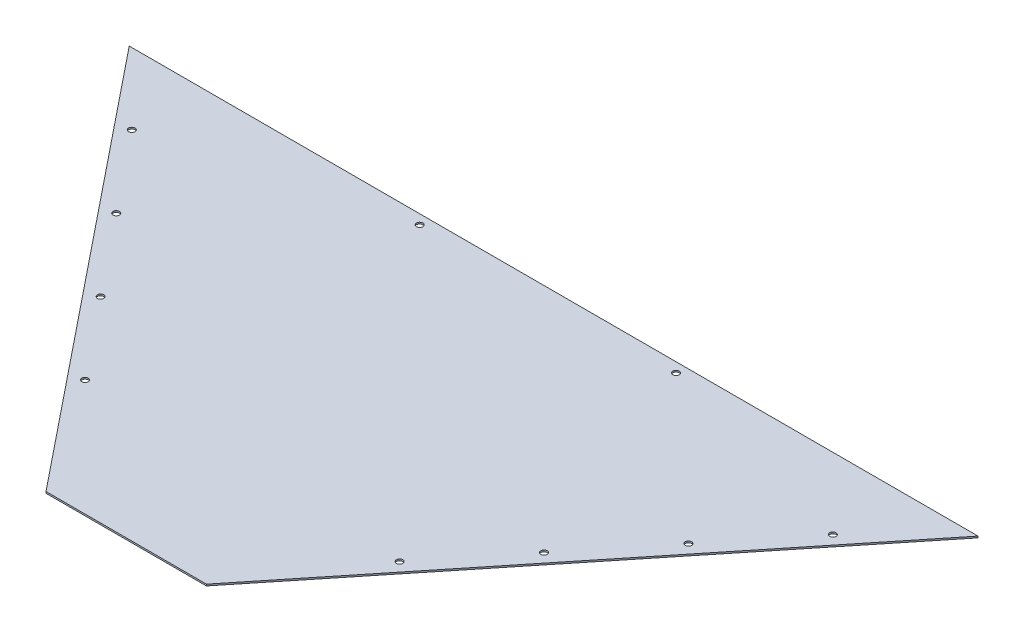
ISO-10303-21;
HEADER;
FILE_DESCRIPTION(('STEP AP214'),'2;1');
FILE_NAME('part.step','',(''),(''),'','','');
FILE_SCHEMA(('AUTOMOTIVE_DESIGN { 1 0 10303 214 1 1 1 1 }'));
ENDSEC;
DATA;
#1=APPLICATION_CONTEXT('core data for automotive mechanical design processes');
#2=APPLICATION_PROTOCOL_DEFINITION('international standard','automotive_design',2000,#1);
#3=PRODUCT_CONTEXT('',#1,'mechanical');
#4=PRODUCT('Part','Part','',(#3));
#5=PRODUCT_RELATED_PRODUCT_CATEGORY('part','',(#4));
#6=PRODUCT_DEFINITION_FORMATION('','',#4);
#7=PRODUCT_DEFINITION_CONTEXT('part definition',#1,'design');
#8=PRODUCT_DEFINITION('design','',#6,#7);
#9=PRODUCT_DEFINITION_SHAPE('','',#8);
#10=(LENGTH_UNIT() NAMED_UNIT(*) SI_UNIT(.MILLI.,.METRE.));
#11=(NAMED_UNIT(*) PLANE_ANGLE_UNIT() SI_UNIT($,.RADIAN.));
#12=(NAMED_UNIT(*) SI_UNIT($,.STERADIAN.) SOLID_ANGLE_UNIT());
#13=UNCERTAINTY_MEASURE_WITH_UNIT(LENGTH_MEASURE(1.E-05),#10,'distance_accuracy_value','');
#14=(GEOMETRIC_REPRESENTATION_CONTEXT(3) GLOBAL_UNCERTAINTY_ASSIGNED_CONTEXT((#13)) GLOBAL_UNIT_ASSIGNED_CONTEXT((#10,
#11,#12)) REPRESENTATION_CONTEXT('',''));
#15=CARTESIAN_POINT('',(0.,0.,0.));
#16=DIRECTION('',(0.,0.,1.));
#17=DIRECTION('',(1.,0.,0.));
#18=AXIS2_PLACEMENT_3D('',#15,#16,#17);
#19=CARTESIAN_POINT('',(-681.0375,3.175,-845.729357474216));
#20=DIRECTION('',(0.778863892318659,0.,-0.62719298245614));
#21=DIRECTION('',(-0.627192982456141,0.,-0.778863892318659));
#22=AXIS2_PLACEMENT_3D('',#19,#20,#21);
#23=PLANE('',#22);
#24=DIRECTION('',(0.62719298245614,0.,0.778863892318659));
#25=VECTOR('',#24,1.);
#26=CARTESIAN_POINT('',(-681.0375,0.,-845.729357474216));
#27=LINE('',#26,#25);
#28=CARTESIAN_POINT('',(-681.0375,0.,-845.729357474216));
#29=VERTEX_POINT('',#28);
#30=CARTESIAN_POINT('',(0.,0.,0.));
#31=VERTEX_POINT('',#30);
#32=EDGE_CURVE('E97',#29,#31,#27,.T.);
#33=ORIENTED_EDGE('',*,*,#32,.T.);
#34=DIRECTION('',(0.,-1.,0.));
#35=VECTOR('',#34,1.);
#36=CARTESIAN_POINT('',(0.,3.175,0.));
#37=LINE('',#36,#35);
#38=CARTESIAN_POINT('',(0.,3.175,0.));
#39=VERTEX_POINT('',#38);
#40=EDGE_CURVE('E11',#39,#31,#37,.T.);
#41=ORIENTED_EDGE('',*,*,#40,.F.);
#42=DIRECTION('',(0.62719298245614,0.,0.778863892318659));
#43=VECTOR('',#42,1.);
#44=CARTESIAN_POINT('',(-681.0375,3.175,-845.729357474216));
#45=LINE('',#44,#43);
#46=CARTESIAN_POINT('',(-681.0375,3.175,-845.729357474216));
#47=VERTEX_POINT('',#46);
#48=EDGE_CURVE('E85',#47,#39,#45,.T.);
#49=ORIENTED_EDGE('',*,*,#48,.F.);
#50=DIRECTION('',(0.,-1.,0.));
#51=VECTOR('',#50,1.);
#52=CARTESIAN_POINT('',(-681.0375,3.175,-845.729357474216));
#53=LINE('',#52,#51);
#54=EDGE_CURVE('E93',#47,#29,#53,.T.);
#55=ORIENTED_EDGE('',*,*,#54,.T.);
#56=EDGE_LOOP('',(#33,#41,#49,#55));
#57=FACE_BOUND('',#56,.T.);
#58=ADVANCED_FACE('F34',(#57),#23,.F.);
#59=CARTESIAN_POINT('',(0.,3.175,0.));
#60=DIRECTION('',(0.,0.,-1.));
#61=DIRECTION('',(-1.,0.,0.));
#62=AXIS2_PLACEMENT_3D('',#59,#60,#61);
#63=PLANE('',#62);
#64=DIRECTION('',(1.,0.,0.));
#65=VECTOR('',#64,1.);
#66=CARTESIAN_POINT('',(0.,0.,0.));
#67=LINE('',#66,#65);
#68=CARTESIAN_POINT('',(317.5,0.,0.));
#69=VERTEX_POINT('',#68);
#70=EDGE_CURVE('E89',#31,#69,#67,.T.);
#71=ORIENTED_EDGE('',*,*,#70,.T.);
#72=DIRECTION('',(0.,-1.,0.));
#73=VECTOR('',#72,1.);
#74=CARTESIAN_POINT('',(317.5,3.175,0.));
#75=LINE('',#74,#73);
#76=CARTESIAN_POINT('',(317.5,3.175,0.));
#77=VERTEX_POINT('',#76);
#78=EDGE_CURVE('E42',#77,#69,#75,.T.);
#79=ORIENTED_EDGE('',*,*,#78,.F.);
#80=DIRECTION('',(1.,0.,0.));
#81=VECTOR('',#80,1.);
#82=CARTESIAN_POINT('',(0.,3.175,0.));
#83=LINE('',#82,#81);
#84=EDGE_CURVE('E80',#39,#77,#83,.T.);
#85=ORIENTED_EDGE('',*,*,#84,.F.);
#86=ORIENTED_EDGE('',*,*,#40,.T.);
#87=EDGE_LOOP('',(#71,#79,#85,#86));
#88=FACE_BOUND('',#87,.T.);
#89=ADVANCED_FACE('F88',(#88),#63,.F.);
#90=CARTESIAN_POINT('',(317.5,3.175,0.));
#91=DIRECTION('',(-0.778863892318659,0.,-0.62719298245614));
#92=DIRECTION('',(-0.62719298245614,0.,0.778863892318659));
#93=AXIS2_PLACEMENT_3D('',#90,#91,#92);
#94=PLANE('',#93);
#95=DIRECTION('',(0.62719298245614,0.,-0.778863892318659));
#96=VECTOR('',#95,1.);
#97=CARTESIAN_POINT('',(317.5,0.,0.));
#98=LINE('',#97,#96);
#99=CARTESIAN_POINT('',(998.5375,0.,-845.729357474216));
#100=VERTEX_POINT('',#99);
#101=EDGE_CURVE('E67',#69,#100,#98,.T.);
#102=ORIENTED_EDGE('',*,*,#101,.T.);
#103=DIRECTION('',(0.,-1.,0.));
#104=VECTOR('',#103,1.);
#105=CARTESIAN_POINT('',(998.5375,3.175,-845.729357474216));
#106=LINE('',#105,#104);
#107=CARTESIAN_POINT('',(998.5375,3.175,-845.729357474216));
#108=VERTEX_POINT('',#107);
#109=EDGE_CURVE('E90',#108,#100,#106,.T.);
#110=ORIENTED_EDGE('',*,*,#109,.F.);
#111=DIRECTION('',(0.62719298245614,0.,-0.778863892318659));
#112=VECTOR('',#111,1.);
#113=CARTESIAN_POINT('',(317.5,3.175,0.));
#114=LINE('',#113,#112);
#115=EDGE_CURVE('E83',#77,#108,#114,.T.);
#116=ORIENTED_EDGE('',*,*,#115,.F.);
#117=ORIENTED_EDGE('',*,*,#78,.T.);
#118=EDGE_LOOP('',(#102,#110,#116,#117));
#119=FACE_BOUND('',#118,.T.);
#120=ADVANCED_FACE('F91',(#119),#94,.F.);
#121=CARTESIAN_POINT('',(998.5375,3.175,-845.729357474216));
#122=DIRECTION('',(0.,0.,1.));
#123=DIRECTION('',(1.,0.,0.));
#124=AXIS2_PLACEMENT_3D('',#121,#122,#123);
#125=PLANE('',#124);
#126=DIRECTION('',(-1.,0.,0.));
#127=VECTOR('',#126,1.);
#128=CARTESIAN_POINT('',(998.5375,0.,-845.729357474216));
#129=LINE('',#128,#127);
#130=EDGE_CURVE('E73',#100,#29,#129,.T.);
#131=ORIENTED_EDGE('',*,*,#130,.T.);
#132=ORIENTED_EDGE('',*,*,#54,.F.);
#133=DIRECTION('',(-1.,0.,0.));
#134=VECTOR('',#133,1.);
#135=CARTESIAN_POINT('',(998.5375,3.175,-845.729357474216));
#136=LINE('',#135,#134);
#137=EDGE_CURVE('E50',#108,#47,#136,.T.);
#138=ORIENTED_EDGE('',*,*,#137,.F.);
#139=ORIENTED_EDGE('',*,*,#109,.T.);
#140=EDGE_LOOP('',(#131,#132,#138,#139));
#141=FACE_BOUND('',#140,.T.);
#142=ADVANCED_FACE('F105',(#141),#125,.F.);
#143=CARTESIAN_POINT('',(158.75,3.175,197.13971036695));
#144=DIRECTION('',(0.,1.,0.));
#145=DIRECTION('',(0.,0.,1.));
#146=AXIS2_PLACEMENT_3D('',#143,#144,#145);
#147=PLANE('',#146);
#148=CARTESIAN_POINT('',(-152.471489871306,3.175,-229.840801955833));
#149=DIRECTION('',(0.,1.,0.));
#150=DIRECTION('',(0.,0.,-1.));
#151=AXIS2_PLACEMENT_3D('',#148,#149,#150);
#152=CIRCLE('',#151,6.34999999999999);
#153=CARTESIAN_POINT('',(-152.471489871306,3.175,-236.190801955833));
#154=VERTEX_POINT('',#153);
#155=EDGE_CURVE('E165',#154,#154,#152,.T.);
#156=ORIENTED_EDGE('',*,*,#155,.F.);
#157=EDGE_LOOP('',(#156));
#158=FACE_BOUND('',#157,.T.);
#159=CARTESIAN_POINT('',(-279.917103906393,3.175,-388.105944874985));
#160=DIRECTION('',(0.,1.,0.));
#161=DIRECTION('',(0.,0.,-1.));
#162=AXIS2_PLACEMENT_3D('',#159,#160,#161);
#163=CIRCLE('',#162,6.34999999999994);
#164=CARTESIAN_POINT('',(-279.917103906393,3.175,-394.455944874985));
#165=VERTEX_POINT('',#164);
#166=EDGE_CURVE('E159',#165,#165,#163,.T.);
#167=ORIENTED_EDGE('',*,*,#166,.F.);
#168=EDGE_LOOP('',(#167));
#169=FACE_BOUND('',#168,.T.);
#170=CARTESIAN_POINT('',(-407.362717941481,3.175,-546.371087794137));
#171=DIRECTION('',(0.,1.,0.));
#172=DIRECTION('',(0.,0.,-1.));
#173=AXIS2_PLACEMENT_3D('',#170,#171,#172);
#174=CIRCLE('',#173,6.34999999999994);
#175=CARTESIAN_POINT('',(-407.362717941481,3.175,-552.721087794137));
#176=VERTEX_POINT('',#175);
#177=EDGE_CURVE('E153',#176,#176,#174,.T.);
#178=ORIENTED_EDGE('',*,*,#177,.F.);
#179=EDGE_LOOP('',(#178));
#180=FACE_BOUND('',#179,.T.);
#181=CARTESIAN_POINT('',(-534.808331976569,3.175,-704.636230713288));
#182=DIRECTION('',(0.,1.,0.));
#183=DIRECTION('',(0.,0.,-1.));
#184=AXIS2_PLACEMENT_3D('',#181,#182,#183);
#185=CIRCLE('',#184,6.34999999999994);
#186=CARTESIAN_POINT('',(-534.808331976569,3.175,-710.986230713288));
#187=VERTEX_POINT('',#186);
#188=EDGE_CURVE('E147',#187,#187,#185,.T.);
#189=ORIENTED_EDGE('',*,*,#188,.F.);
#190=EDGE_LOOP('',(#189));
#191=FACE_BOUND('',#190,.T.);
#192=CARTESIAN_POINT('',(597.417103906393,3.175,-388.105944874985));
#193=DIRECTION('',(0.,1.,0.));
#194=DIRECTION('',(0.,0.,1.));
#195=AXIS2_PLACEMENT_3D('',#192,#193,#194);
#196=CIRCLE('',#195,6.34999999999994);
#197=CARTESIAN_POINT('',(597.417103906393,3.175,-381.755944874985));
#198=VERTEX_POINT('',#197);
#199=EDGE_CURVE('E141',#198,#198,#196,.T.);
#200=ORIENTED_EDGE('',*,*,#199,.F.);
#201=EDGE_LOOP('',(#200));
#202=FACE_BOUND('',#201,.T.);
#203=CARTESIAN_POINT('',(724.862717941481,3.175,-546.371087794137));
#204=DIRECTION('',(0.,1.,0.));
#205=DIRECTION('',(0.,0.,1.));
#206=AXIS2_PLACEMENT_3D('',#203,#204,#205);
#207=CIRCLE('',#206,6.34999999999994);
#208=CARTESIAN_POINT('',(724.862717941481,3.175,-540.021087794137));
#209=VERTEX_POINT('',#208);
#210=EDGE_CURVE('E135',#209,#209,#207,.T.);
#211=ORIENTED_EDGE('',*,*,#210,.F.);
#212=EDGE_LOOP('',(#211));
#213=FACE_BOUND('',#212,.T.);
#214=CARTESIAN_POINT('',(469.971489871306,3.175,-229.840801955834));
#215=DIRECTION('',(0.,1.,0.));
#216=DIRECTION('',(0.,0.,1.));
#217=AXIS2_PLACEMENT_3D('',#214,#215,#216);
#218=CIRCLE('',#217,6.34999999999999);
#219=CARTESIAN_POINT('',(469.971489871306,3.175,-223.490801955834));
#220=VERTEX_POINT('',#219);
#221=EDGE_CURVE('E129',#220,#220,#218,.T.);
#222=ORIENTED_EDGE('',*,*,#221,.F.);
#223=EDGE_LOOP('',(#222));
#224=FACE_BOUND('',#223,.T.);
#225=CARTESIAN_POINT('',(852.308331976569,3.175,-704.636230713288));
#226=DIRECTION('',(0.,1.,0.));
#227=DIRECTION('',(0.,0.,1.));
#228=AXIS2_PLACEMENT_3D('',#225,#226,#227);
#229=CIRCLE('',#228,6.34999999999994);
#230=CARTESIAN_POINT('',(852.308331976569,3.175,-698.286230713288));
#231=VERTEX_POINT('',#230);
#232=EDGE_CURVE('E123',#231,#231,#229,.T.);
#233=ORIENTED_EDGE('',*,*,#232,.F.);
#234=EDGE_LOOP('',(#233));
#235=FACE_BOUND('',#234,.T.);
#236=CARTESIAN_POINT('',(420.1795,3.175,-826.679357474216));
#237=DIRECTION('',(0.,1.,0.));
#238=DIRECTION('',(0.,0.,1.));
#239=AXIS2_PLACEMENT_3D('',#236,#237,#238);
#240=CIRCLE('',#239,6.34999999999994);
#241=CARTESIAN_POINT('',(420.1795,3.175,-820.329357474216));
#242=VERTEX_POINT('',#241);
#243=EDGE_CURVE('E119',#242,#242,#240,.T.);
#244=ORIENTED_EDGE('',*,*,#243,.F.);
#245=EDGE_LOOP('',(#244));
#246=FACE_BOUND('',#245,.T.);
#247=CARTESIAN_POINT('',(-87.1855000000001,3.175,-826.679357474216));
#248=DIRECTION('',(0.,1.,0.));
#249=DIRECTION('',(0.,0.,1.));
#250=AXIS2_PLACEMENT_3D('',#247,#248,#249);
#251=CIRCLE('',#250,6.34999999999999);
#252=CARTESIAN_POINT('',(-87.1855000000001,3.175,-820.329357474216));
#253=VERTEX_POINT('',#252);
#254=EDGE_CURVE('E113',#253,#253,#251,.T.);
#255=ORIENTED_EDGE('',*,*,#254,.F.);
#256=EDGE_LOOP('',(#255));
#257=FACE_BOUND('',#256,.T.);
#258=ORIENTED_EDGE('',*,*,#48,.T.);
#259=ORIENTED_EDGE('',*,*,#84,.T.);
#260=ORIENTED_EDGE('',*,*,#115,.T.);
#261=ORIENTED_EDGE('',*,*,#137,.T.);
#262=EDGE_LOOP('',(#258,#259,#260,#261));
#263=FACE_BOUND('',#262,.T.);
#264=ADVANCED_FACE('F81',(#158,#169,#180,#191,#202,#213,#224,#235,#246,#257,#263),#147,.T.);
#265=CARTESIAN_POINT('',(158.75,0.,197.13971036695));
#266=DIRECTION('',(0.,1.,0.));
#267=DIRECTION('',(0.,0.,1.));
#268=AXIS2_PLACEMENT_3D('',#265,#266,#267);
#269=PLANE('',#268);
#270=CARTESIAN_POINT('',(-152.471489871306,0.,-229.840801955833));
#271=DIRECTION('',(0.,1.,0.));
#272=DIRECTION('',(0.,0.,-1.));
#273=AXIS2_PLACEMENT_3D('',#270,#271,#272);
#274=CIRCLE('',#273,6.34999999999999);
#275=CARTESIAN_POINT('',(-152.471489871306,0.,-236.190801955833));
#276=VERTEX_POINT('',#275);
#277=EDGE_CURVE('E162',#276,#276,#274,.T.);
#278=ORIENTED_EDGE('',*,*,#277,.T.);
#279=EDGE_LOOP('',(#278));
#280=FACE_BOUND('',#279,.T.);
#281=CARTESIAN_POINT('',(-279.917103906393,0.,-388.105944874985));
#282=DIRECTION('',(0.,1.,0.));
#283=DIRECTION('',(0.,0.,-1.));
#284=AXIS2_PLACEMENT_3D('',#281,#282,#283);
#285=CIRCLE('',#284,6.34999999999994);
#286=CARTESIAN_POINT('',(-279.917103906393,0.,-394.455944874985));
#287=VERTEX_POINT('',#286);
#288=EDGE_CURVE('E156',#287,#287,#285,.T.);
#289=ORIENTED_EDGE('',*,*,#288,.T.);
#290=EDGE_LOOP('',(#289));
#291=FACE_BOUND('',#290,.T.);
#292=CARTESIAN_POINT('',(-407.362717941481,0.,-546.371087794137));
#293=DIRECTION('',(0.,1.,0.));
#294=DIRECTION('',(0.,0.,-1.));
#295=AXIS2_PLACEMENT_3D('',#292,#293,#294);
#296=CIRCLE('',#295,6.34999999999994);
#297=CARTESIAN_POINT('',(-407.362717941481,0.,-552.721087794137));
#298=VERTEX_POINT('',#297);
#299=EDGE_CURVE('E150',#298,#298,#296,.T.);
#300=ORIENTED_EDGE('',*,*,#299,.T.);
#301=EDGE_LOOP('',(#300));
#302=FACE_BOUND('',#301,.T.);
#303=CARTESIAN_POINT('',(-534.808331976569,0.,-704.636230713288));
#304=DIRECTION('',(0.,1.,0.));
#305=DIRECTION('',(0.,0.,-1.));
#306=AXIS2_PLACEMENT_3D('',#303,#304,#305);
#307=CIRCLE('',#306,6.34999999999994);
#308=CARTESIAN_POINT('',(-534.808331976569,0.,-710.986230713288));
#309=VERTEX_POINT('',#308);
#310=EDGE_CURVE('E144',#309,#309,#307,.T.);
#311=ORIENTED_EDGE('',*,*,#310,.T.);
#312=EDGE_LOOP('',(#311));
#313=FACE_BOUND('',#312,.T.);
#314=CARTESIAN_POINT('',(597.417103906393,0.,-388.105944874985));
#315=DIRECTION('',(0.,1.,0.));
#316=DIRECTION('',(0.,0.,1.));
#317=AXIS2_PLACEMENT_3D('',#314,#315,#316);
#318=CIRCLE('',#317,6.34999999999994);
#319=CARTESIAN_POINT('',(597.417103906393,0.,-381.755944874985));
#320=VERTEX_POINT('',#319);
#321=EDGE_CURVE('E138',#320,#320,#318,.T.);
#322=ORIENTED_EDGE('',*,*,#321,.T.);
#323=EDGE_LOOP('',(#322));
#324=FACE_BOUND('',#323,.T.);
#325=CARTESIAN_POINT('',(724.862717941481,0.,-546.371087794137));
#326=DIRECTION('',(0.,1.,0.));
#327=DIRECTION('',(0.,0.,1.));
#328=AXIS2_PLACEMENT_3D('',#325,#326,#327);
#329=CIRCLE('',#328,6.34999999999994);
#330=CARTESIAN_POINT('',(724.862717941481,0.,-540.021087794137));
#331=VERTEX_POINT('',#330);
#332=EDGE_CURVE('E132',#331,#331,#329,.T.);
#333=ORIENTED_EDGE('',*,*,#332,.T.);
#334=EDGE_LOOP('',(#333));
#335=FACE_BOUND('',#334,.T.);
#336=CARTESIAN_POINT('',(469.971489871306,0.,-229.840801955834));
#337=DIRECTION('',(0.,1.,0.));
#338=DIRECTION('',(0.,0.,1.));
#339=AXIS2_PLACEMENT_3D('',#336,#337,#338);
#340=CIRCLE('',#339,6.34999999999999);
#341=CARTESIAN_POINT('',(469.971489871306,0.,-223.490801955834));
#342=VERTEX_POINT('',#341);
#343=EDGE_CURVE('E126',#342,#342,#340,.T.);
#344=ORIENTED_EDGE('',*,*,#343,.T.);
#345=EDGE_LOOP('',(#344));
#346=FACE_BOUND('',#345,.T.);
#347=CARTESIAN_POINT('',(852.308331976569,0.,-704.636230713288));
#348=DIRECTION('',(0.,1.,0.));
#349=DIRECTION('',(0.,0.,1.));
#350=AXIS2_PLACEMENT_3D('',#347,#348,#349);
#351=CIRCLE('',#350,6.34999999999994);
#352=CARTESIAN_POINT('',(852.308331976569,0.,-698.286230713288));
#353=VERTEX_POINT('',#352);
#354=EDGE_CURVE('E122',#353,#353,#351,.T.);
#355=ORIENTED_EDGE('',*,*,#354,.T.);
#356=EDGE_LOOP('',(#355));
#357=FACE_BOUND('',#356,.T.);
#358=CARTESIAN_POINT('',(420.1795,0.,-826.679357474216));
#359=DIRECTION('',(0.,1.,0.));
#360=DIRECTION('',(0.,0.,1.));
#361=AXIS2_PLACEMENT_3D('',#358,#359,#360);
#362=CIRCLE('',#361,6.34999999999994);
#363=CARTESIAN_POINT('',(420.1795,0.,-820.329357474216));
#364=VERTEX_POINT('',#363);
#365=EDGE_CURVE('E116',#364,#364,#362,.F.);
#366=ORIENTED_EDGE('',*,*,#365,.F.);
#367=EDGE_LOOP('',(#366));
#368=FACE_BOUND('',#367,.T.);
#369=CARTESIAN_POINT('',(-87.1855000000001,0.,-826.679357474216));
#370=DIRECTION('',(0.,1.,0.));
#371=DIRECTION('',(0.,0.,1.));
#372=AXIS2_PLACEMENT_3D('',#369,#370,#371);
#373=CIRCLE('',#372,6.34999999999999);
#374=CARTESIAN_POINT('',(-87.1855000000001,0.,-820.329357474216));
#375=VERTEX_POINT('',#374);
#376=EDGE_CURVE('E100',#375,#375,#373,.F.);
#377=ORIENTED_EDGE('',*,*,#376,.F.);
#378=EDGE_LOOP('',(#377));
#379=FACE_BOUND('',#378,.T.);
#380=ORIENTED_EDGE('',*,*,#32,.F.);
#381=ORIENTED_EDGE('',*,*,#130,.F.);
#382=ORIENTED_EDGE('',*,*,#101,.F.);
#383=ORIENTED_EDGE('',*,*,#70,.F.);
#384=EDGE_LOOP('',(#380,#381,#382,#383));
#385=FACE_BOUND('',#384,.T.);
#386=ADVANCED_FACE('F108',(#280,#291,#302,#313,#324,#335,#346,#357,#368,#379,#385),#269,.F.);
#387=CARTESIAN_POINT('',(-87.1855000000001,-0.00100000000000013,-826.679357474216));
#388=DIRECTION('',(0.,1.,0.));
#389=DIRECTION('',(0.,0.,1.));
#390=AXIS2_PLACEMENT_3D('',#387,#388,#389);
#391=CYLINDRICAL_SURFACE('',#390,6.34999999999999);
#392=ORIENTED_EDGE('',*,*,#254,.T.);
#393=EDGE_LOOP('',(#392));
#394=FACE_BOUND('',#393,.T.);
#395=ORIENTED_EDGE('',*,*,#376,.T.);
#396=EDGE_LOOP('',(#395));
#397=FACE_BOUND('',#396,.T.);
#398=ADVANCED_FACE('F201',(#394,#397),#391,.F.);
#399=CARTESIAN_POINT('',(420.1795,-0.00100000000000013,-826.679357474216));
#400=DIRECTION('',(0.,1.,0.));
#401=DIRECTION('',(0.,0.,1.));
#402=AXIS2_PLACEMENT_3D('',#399,#400,#401);
#403=CYLINDRICAL_SURFACE('',#402,6.34999999999994);
#404=ORIENTED_EDGE('',*,*,#243,.T.);
#405=EDGE_LOOP('',(#404));
#406=FACE_BOUND('',#405,.T.);
#407=ORIENTED_EDGE('',*,*,#365,.T.);
#408=EDGE_LOOP('',(#407));
#409=FACE_BOUND('',#408,.T.);
#410=ADVANCED_FACE('F204',(#406,#409),#403,.F.);
#411=CARTESIAN_POINT('',(852.308331976569,0.,-704.636230713288));
#412=DIRECTION('',(0.,1.,0.));
#413=DIRECTION('',(0.,0.,1.));
#414=AXIS2_PLACEMENT_3D('',#411,#412,#413);
#415=CYLINDRICAL_SURFACE('',#414,6.34999999999994);
#416=ORIENTED_EDGE('',*,*,#354,.F.);
#417=EDGE_LOOP('',(#416));
#418=FACE_BOUND('',#417,.T.);
#419=ORIENTED_EDGE('',*,*,#232,.T.);
#420=EDGE_LOOP('',(#419));
#421=FACE_BOUND('',#420,.T.);
#422=ADVANCED_FACE('F247',(#418,#421),#415,.F.);
#423=CARTESIAN_POINT('',(469.971489871306,0.,-229.840801955834));
#424=DIRECTION('',(0.,1.,0.));
#425=DIRECTION('',(0.,0.,1.));
#426=AXIS2_PLACEMENT_3D('',#423,#424,#425);
#427=CYLINDRICAL_SURFACE('',#426,6.34999999999999);
#428=ORIENTED_EDGE('',*,*,#343,.F.);
#429=EDGE_LOOP('',(#428));
#430=FACE_BOUND('',#429,.T.);
#431=ORIENTED_EDGE('',*,*,#221,.T.);
#432=EDGE_LOOP('',(#431));
#433=FACE_BOUND('',#432,.T.);
#434=ADVANCED_FACE('F254',(#430,#433),#427,.F.);
#435=CARTESIAN_POINT('',(724.862717941481,0.,-546.371087794137));
#436=DIRECTION('',(0.,1.,0.));
#437=DIRECTION('',(0.,0.,1.));
#438=AXIS2_PLACEMENT_3D('',#435,#436,#437);
#439=CYLINDRICAL_SURFACE('',#438,6.34999999999994);
#440=ORIENTED_EDGE('',*,*,#332,.F.);
#441=EDGE_LOOP('',(#440));
#442=FACE_BOUND('',#441,.T.);
#443=ORIENTED_EDGE('',*,*,#210,.T.);
#444=EDGE_LOOP('',(#443));
#445=FACE_BOUND('',#444,.T.);
#446=ADVANCED_FACE('F262',(#442,#445),#439,.F.);
#447=CARTESIAN_POINT('',(597.417103906393,0.,-388.105944874985));
#448=DIRECTION('',(0.,1.,0.));
#449=DIRECTION('',(0.,0.,1.));
#450=AXIS2_PLACEMENT_3D('',#447,#448,#449);
#451=CYLINDRICAL_SURFACE('',#450,6.34999999999994);
#452=ORIENTED_EDGE('',*,*,#321,.F.);
#453=EDGE_LOOP('',(#452));
#454=FACE_BOUND('',#453,.T.);
#455=ORIENTED_EDGE('',*,*,#199,.T.);
#456=EDGE_LOOP('',(#455));
#457=FACE_BOUND('',#456,.T.);
#458=ADVANCED_FACE('F270',(#454,#457),#451,.F.);
#459=CARTESIAN_POINT('',(-534.808331976569,0.,-704.636230713288));
#460=DIRECTION('',(0.,1.,0.));
#461=DIRECTION('',(0.,0.,1.));
#462=AXIS2_PLACEMENT_3D('',#459,#460,#461);
#463=CYLINDRICAL_SURFACE('',#462,6.34999999999994);
#464=ORIENTED_EDGE('',*,*,#310,.F.);
#465=EDGE_LOOP('',(#464));
#466=FACE_BOUND('',#465,.T.);
#467=ORIENTED_EDGE('',*,*,#188,.T.);
#468=EDGE_LOOP('',(#467));
#469=FACE_BOUND('',#468,.T.);
#470=ADVANCED_FACE('F278',(#466,#469),#463,.F.);
#471=CARTESIAN_POINT('',(-407.362717941481,0.,-546.371087794137));
#472=DIRECTION('',(0.,1.,0.));
#473=DIRECTION('',(0.,0.,1.));
#474=AXIS2_PLACEMENT_3D('',#471,#472,#473);
#475=CYLINDRICAL_SURFACE('',#474,6.34999999999994);
#476=ORIENTED_EDGE('',*,*,#299,.F.);
#477=EDGE_LOOP('',(#476));
#478=FACE_BOUND('',#477,.T.);
#479=ORIENTED_EDGE('',*,*,#177,.T.);
#480=EDGE_LOOP('',(#479));
#481=FACE_BOUND('',#480,.T.);
#482=ADVANCED_FACE('F286',(#478,#481),#475,.F.);
#483=CARTESIAN_POINT('',(-279.917103906393,0.,-388.105944874985));
#484=DIRECTION('',(0.,1.,0.));
#485=DIRECTION('',(0.,0.,1.));
#486=AXIS2_PLACEMENT_3D('',#483,#484,#485);
#487=CYLINDRICAL_SURFACE('',#486,6.34999999999994);
#488=ORIENTED_EDGE('',*,*,#288,.F.);
#489=EDGE_LOOP('',(#488));
#490=FACE_BOUND('',#489,.T.);
#491=ORIENTED_EDGE('',*,*,#166,.T.);
#492=EDGE_LOOP('',(#491));
#493=FACE_BOUND('',#492,.T.);
#494=ADVANCED_FACE('F176',(#490,#493),#487,.F.);
#495=CARTESIAN_POINT('',(-152.471489871306,0.,-229.840801955833));
#496=DIRECTION('',(0.,1.,0.));
#497=DIRECTION('',(0.,0.,1.));
#498=AXIS2_PLACEMENT_3D('',#495,#496,#497);
#499=CYLINDRICAL_SURFACE('',#498,6.34999999999999);
#500=ORIENTED_EDGE('',*,*,#277,.F.);
#501=EDGE_LOOP('',(#500));
#502=FACE_BOUND('',#501,.T.);
#503=ORIENTED_EDGE('',*,*,#155,.T.);
#504=EDGE_LOOP('',(#503));
#505=FACE_BOUND('',#504,.T.);
#506=ADVANCED_FACE('F173',(#502,#505),#499,.F.);
#507=CLOSED_SHELL('',(#58,#89,#120,#142,#264,#386,#398,#410,#422,#434,#446,#458,#470,#482,#494,#506));
#508=MANIFOLD_SOLID_BREP('B2',#507);
#509=ADVANCED_BREP_SHAPE_REPRESENTATION('',(#18,#508),#14);
#510=SHAPE_DEFINITION_REPRESENTATION(#9,#509);
ENDSEC;
END-ISO-10303-21;
